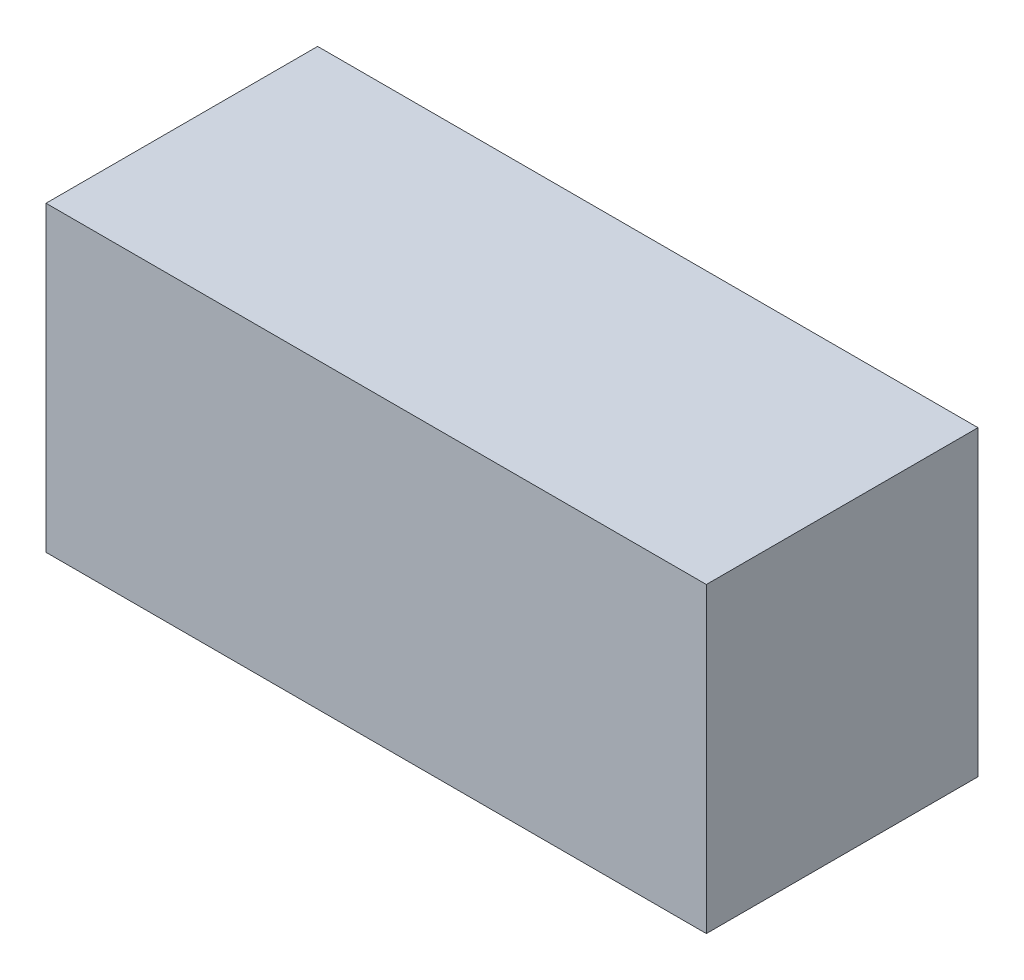
ISO-10303-21;
HEADER;
FILE_DESCRIPTION(('STEP AP214'),'2;1');
FILE_NAME('part.step','',(''),(''),'','','');
FILE_SCHEMA(('AUTOMOTIVE_DESIGN { 1 0 10303 214 1 1 1 1 }'));
ENDSEC;
DATA;
#1=APPLICATION_CONTEXT('core data for automotive mechanical design processes');
#2=APPLICATION_PROTOCOL_DEFINITION('international standard','automotive_design',2000,#1);
#3=PRODUCT_CONTEXT('',#1,'mechanical');
#4=PRODUCT('Part','Part','',(#3));
#5=PRODUCT_RELATED_PRODUCT_CATEGORY('part','',(#4));
#6=PRODUCT_DEFINITION_FORMATION('','',#4);
#7=PRODUCT_DEFINITION_CONTEXT('part definition',#1,'design');
#8=PRODUCT_DEFINITION('design','',#6,#7);
#9=PRODUCT_DEFINITION_SHAPE('','',#8);
#10=(LENGTH_UNIT() NAMED_UNIT(*) SI_UNIT(.MILLI.,.METRE.));
#11=(NAMED_UNIT(*) PLANE_ANGLE_UNIT() SI_UNIT($,.RADIAN.));
#12=(NAMED_UNIT(*) SI_UNIT($,.STERADIAN.) SOLID_ANGLE_UNIT());
#13=UNCERTAINTY_MEASURE_WITH_UNIT(LENGTH_MEASURE(1.E-05),#10,'distance_accuracy_value','');
#14=(GEOMETRIC_REPRESENTATION_CONTEXT(3) GLOBAL_UNCERTAINTY_ASSIGNED_CONTEXT((#13)) GLOBAL_UNIT_ASSIGNED_CONTEXT((#10,
#11,#12)) REPRESENTATION_CONTEXT('',''));
#15=CARTESIAN_POINT('',(0.,0.,0.));
#16=DIRECTION('',(0.,0.,1.));
#17=DIRECTION('',(1.,0.,0.));
#18=AXIS2_PLACEMENT_3D('',#15,#16,#17);
#19=CARTESIAN_POINT('',(-24.31,-11.13,20.));
#20=DIRECTION('',(-1.,0.,0.));
#21=DIRECTION('',(0.,0.,1.));
#22=AXIS2_PLACEMENT_3D('',#19,#20,#21);
#23=PLANE('',#22);
#24=DIRECTION('',(0.,1.,0.));
#25=VECTOR('',#24,1.);
#26=CARTESIAN_POINT('',(-24.31,-11.13,0.));
#27=LINE('',#26,#25);
#28=CARTESIAN_POINT('',(-24.31,-11.13,0.));
#29=VERTEX_POINT('',#28);
#30=CARTESIAN_POINT('',(-24.31,11.13,0.));
#31=VERTEX_POINT('',#30);
#32=EDGE_CURVE('E98',#29,#31,#27,.T.);
#33=ORIENTED_EDGE('',*,*,#32,.F.);
#34=DIRECTION('',(0.,0.,-1.));
#35=VECTOR('',#34,1.);
#36=CARTESIAN_POINT('',(-24.31,-11.13,20.));
#37=LINE('',#36,#35);
#38=CARTESIAN_POINT('',(-24.31,-11.13,20.));
#39=VERTEX_POINT('',#38);
#40=EDGE_CURVE('E11',#39,#29,#37,.T.);
#41=ORIENTED_EDGE('',*,*,#40,.F.);
#42=DIRECTION('',(0.,1.,0.));
#43=VECTOR('',#42,1.);
#44=CARTESIAN_POINT('',(-24.31,-11.13,20.));
#45=LINE('',#44,#43);
#46=CARTESIAN_POINT('',(-24.31,11.13,20.));
#47=VERTEX_POINT('',#46);
#48=EDGE_CURVE('E93',#39,#47,#45,.T.);
#49=ORIENTED_EDGE('',*,*,#48,.T.);
#50=DIRECTION('',(0.,0.,-1.));
#51=VECTOR('',#50,1.);
#52=CARTESIAN_POINT('',(-24.31,11.13,20.));
#53=LINE('',#52,#51);
#54=EDGE_CURVE('E36',#47,#31,#53,.T.);
#55=ORIENTED_EDGE('',*,*,#54,.T.);
#56=EDGE_LOOP('',(#33,#41,#49,#55));
#57=FACE_BOUND('',#56,.T.);
#58=ADVANCED_FACE('F33',(#57),#23,.T.);
#59=CARTESIAN_POINT('',(-24.31,-11.13,20.));
#60=DIRECTION('',(0.,1.,0.));
#61=DIRECTION('',(0.,0.,1.));
#62=AXIS2_PLACEMENT_3D('',#59,#60,#61);
#63=PLANE('',#62);
#64=DIRECTION('',(1.,0.,0.));
#65=VECTOR('',#64,1.);
#66=CARTESIAN_POINT('',(-24.31,-11.13,0.));
#67=LINE('',#66,#65);
#68=CARTESIAN_POINT('',(24.31,-11.13,0.));
#69=VERTEX_POINT('',#68);
#70=EDGE_CURVE('E66',#29,#69,#67,.T.);
#71=ORIENTED_EDGE('',*,*,#70,.T.);
#72=DIRECTION('',(0.,0.,-1.));
#73=VECTOR('',#72,1.);
#74=CARTESIAN_POINT('',(24.31,-11.13,20.));
#75=LINE('',#74,#73);
#76=CARTESIAN_POINT('',(24.31,-11.13,20.));
#77=VERTEX_POINT('',#76);
#78=EDGE_CURVE('E42',#77,#69,#75,.T.);
#79=ORIENTED_EDGE('',*,*,#78,.F.);
#80=DIRECTION('',(1.,0.,0.));
#81=VECTOR('',#80,1.);
#82=CARTESIAN_POINT('',(-24.31,-11.13,20.));
#83=LINE('',#82,#81);
#84=EDGE_CURVE('E83',#39,#77,#83,.T.);
#85=ORIENTED_EDGE('',*,*,#84,.F.);
#86=ORIENTED_EDGE('',*,*,#40,.T.);
#87=EDGE_LOOP('',(#71,#79,#85,#86));
#88=FACE_BOUND('',#87,.T.);
#89=ADVANCED_FACE('F108',(#88),#63,.F.);
#90=CARTESIAN_POINT('',(24.31,-11.13,20.));
#91=DIRECTION('',(-1.,0.,0.));
#92=DIRECTION('',(0.,0.,1.));
#93=AXIS2_PLACEMENT_3D('',#90,#91,#92);
#94=PLANE('',#93);
#95=DIRECTION('',(0.,1.,0.));
#96=VECTOR('',#95,1.);
#97=CARTESIAN_POINT('',(24.31,-11.13,0.));
#98=LINE('',#97,#96);
#99=CARTESIAN_POINT('',(24.31,11.13,0.));
#100=VERTEX_POINT('',#99);
#101=EDGE_CURVE('E90',#69,#100,#98,.T.);
#102=ORIENTED_EDGE('',*,*,#101,.T.);
#103=DIRECTION('',(0.,0.,-1.));
#104=VECTOR('',#103,1.);
#105=CARTESIAN_POINT('',(24.31,11.13,20.));
#106=LINE('',#105,#104);
#107=CARTESIAN_POINT('',(24.31,11.13,20.));
#108=VERTEX_POINT('',#107);
#109=EDGE_CURVE('E87',#108,#100,#106,.T.);
#110=ORIENTED_EDGE('',*,*,#109,.F.);
#111=DIRECTION('',(0.,1.,0.));
#112=VECTOR('',#111,1.);
#113=CARTESIAN_POINT('',(24.31,-11.13,20.));
#114=LINE('',#113,#112);
#115=EDGE_CURVE('E78',#77,#108,#114,.T.);
#116=ORIENTED_EDGE('',*,*,#115,.F.);
#117=ORIENTED_EDGE('',*,*,#78,.T.);
#118=EDGE_LOOP('',(#102,#110,#116,#117));
#119=FACE_BOUND('',#118,.T.);
#120=ADVANCED_FACE('F88',(#119),#94,.F.);
#121=CARTESIAN_POINT('',(-24.31,11.13,20.));
#122=DIRECTION('',(0.,1.,0.));
#123=DIRECTION('',(0.,0.,1.));
#124=AXIS2_PLACEMENT_3D('',#121,#122,#123);
#125=PLANE('',#124);
#126=DIRECTION('',(1.,0.,0.));
#127=VECTOR('',#126,1.);
#128=CARTESIAN_POINT('',(-24.31,11.13,0.));
#129=LINE('',#128,#127);
#130=EDGE_CURVE('E101',#31,#100,#129,.T.);
#131=ORIENTED_EDGE('',*,*,#130,.F.);
#132=ORIENTED_EDGE('',*,*,#54,.F.);
#133=DIRECTION('',(1.,0.,0.));
#134=VECTOR('',#133,1.);
#135=CARTESIAN_POINT('',(-24.31,11.13,20.));
#136=LINE('',#135,#134);
#137=EDGE_CURVE('E82',#47,#108,#136,.T.);
#138=ORIENTED_EDGE('',*,*,#137,.T.);
#139=ORIENTED_EDGE('',*,*,#109,.T.);
#140=EDGE_LOOP('',(#131,#132,#138,#139));
#141=FACE_BOUND('',#140,.T.);
#142=ADVANCED_FACE('F92',(#141),#125,.T.);
#143=CARTESIAN_POINT('',(0.,0.,20.));
#144=DIRECTION('',(0.,0.,-1.));
#145=DIRECTION('',(-1.,0.,0.));
#146=AXIS2_PLACEMENT_3D('',#143,#144,#145);
#147=PLANE('',#146);
#148=ORIENTED_EDGE('',*,*,#48,.F.);
#149=ORIENTED_EDGE('',*,*,#84,.T.);
#150=ORIENTED_EDGE('',*,*,#115,.T.);
#151=ORIENTED_EDGE('',*,*,#137,.F.);
#152=EDGE_LOOP('',(#148,#149,#150,#151));
#153=FACE_BOUND('',#152,.T.);
#154=ADVANCED_FACE('F81',(#153),#147,.F.);
#155=CARTESIAN_POINT('',(0.,0.,0.));
#156=DIRECTION('',(0.,0.,-1.));
#157=DIRECTION('',(-1.,0.,0.));
#158=AXIS2_PLACEMENT_3D('',#155,#156,#157);
#159=PLANE('',#158);
#160=ORIENTED_EDGE('',*,*,#32,.T.);
#161=ORIENTED_EDGE('',*,*,#130,.T.);
#162=ORIENTED_EDGE('',*,*,#101,.F.);
#163=ORIENTED_EDGE('',*,*,#70,.F.);
#164=EDGE_LOOP('',(#160,#161,#162,#163));
#165=FACE_BOUND('',#164,.T.);
#166=ADVANCED_FACE('F106',(#165),#159,.T.);
#167=CLOSED_SHELL('',(#58,#89,#120,#142,#154,#166));
#168=MANIFOLD_SOLID_BREP('B2',#167);
#169=ADVANCED_BREP_SHAPE_REPRESENTATION('',(#18,#168),#14);
#170=SHAPE_DEFINITION_REPRESENTATION(#9,#169);
ENDSEC;
END-ISO-10303-21;
